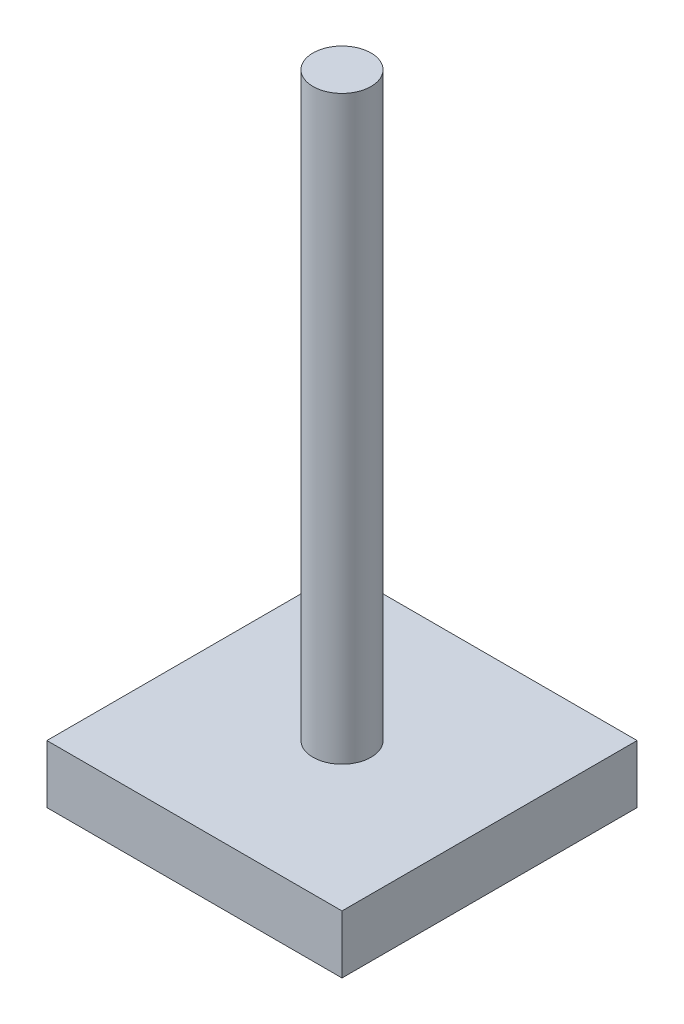
ISO-10303-21;
HEADER;
FILE_DESCRIPTION(('STEP AP214'),'2;1');
FILE_NAME('part.step','',(''),(''),'','','');
FILE_SCHEMA(('AUTOMOTIVE_DESIGN { 1 0 10303 214 1 1 1 1 }'));
ENDSEC;
DATA;
#1=APPLICATION_CONTEXT('core data for automotive mechanical design processes');
#2=APPLICATION_PROTOCOL_DEFINITION('international standard','automotive_design',2000,#1);
#3=PRODUCT_CONTEXT('',#1,'mechanical');
#4=PRODUCT('Part','Part','',(#3));
#5=PRODUCT_RELATED_PRODUCT_CATEGORY('part','',(#4));
#6=PRODUCT_DEFINITION_FORMATION('','',#4);
#7=PRODUCT_DEFINITION_CONTEXT('part definition',#1,'design');
#8=PRODUCT_DEFINITION('design','',#6,#7);
#9=PRODUCT_DEFINITION_SHAPE('','',#8);
#10=(LENGTH_UNIT() NAMED_UNIT(*) SI_UNIT(.MILLI.,.METRE.));
#11=(NAMED_UNIT(*) PLANE_ANGLE_UNIT() SI_UNIT($,.RADIAN.));
#12=(NAMED_UNIT(*) SI_UNIT($,.STERADIAN.) SOLID_ANGLE_UNIT());
#13=UNCERTAINTY_MEASURE_WITH_UNIT(LENGTH_MEASURE(1.E-05),#10,'distance_accuracy_value','');
#14=(GEOMETRIC_REPRESENTATION_CONTEXT(3) GLOBAL_UNCERTAINTY_ASSIGNED_CONTEXT((#13)) GLOBAL_UNIT_ASSIGNED_CONTEXT((#10,
#11,#12)) REPRESENTATION_CONTEXT('',''));
#15=CARTESIAN_POINT('',(0.,0.,0.));
#16=DIRECTION('',(0.,0.,1.));
#17=DIRECTION('',(1.,0.,0.));
#18=AXIS2_PLACEMENT_3D('',#15,#16,#17);
#19=CARTESIAN_POINT('',(-25.4,10.,25.4));
#20=DIRECTION('',(0.,0.,-1.));
#21=DIRECTION('',(-1.,0.,0.));
#22=AXIS2_PLACEMENT_3D('',#19,#20,#21);
#23=PLANE('',#22);
#24=DIRECTION('',(1.,0.,0.));
#25=VECTOR('',#24,1.);
#26=CARTESIAN_POINT('',(-25.4,0.,25.4));
#27=LINE('',#26,#25);
#28=CARTESIAN_POINT('',(-25.4,0.,25.4));
#29=VERTEX_POINT('',#28);
#30=CARTESIAN_POINT('',(25.4,0.,25.4));
#31=VERTEX_POINT('',#30);
#32=EDGE_CURVE('E107',#29,#31,#27,.T.);
#33=ORIENTED_EDGE('',*,*,#32,.T.);
#34=DIRECTION('',(0.,-1.,0.));
#35=VECTOR('',#34,1.);
#36=CARTESIAN_POINT('',(25.4,10.,25.4));
#37=LINE('',#36,#35);
#38=CARTESIAN_POINT('',(25.4,10.,25.4));
#39=VERTEX_POINT('',#38);
#40=EDGE_CURVE('E11',#39,#31,#37,.T.);
#41=ORIENTED_EDGE('',*,*,#40,.F.);
#42=DIRECTION('',(1.,0.,0.));
#43=VECTOR('',#42,1.);
#44=CARTESIAN_POINT('',(-25.4,10.,25.4));
#45=LINE('',#44,#43);
#46=CARTESIAN_POINT('',(-25.4,10.,25.4));
#47=VERTEX_POINT('',#46);
#48=EDGE_CURVE('E89',#47,#39,#45,.T.);
#49=ORIENTED_EDGE('',*,*,#48,.F.);
#50=DIRECTION('',(0.,-1.,0.));
#51=VECTOR('',#50,1.);
#52=CARTESIAN_POINT('',(-25.4,10.,25.4));
#53=LINE('',#52,#51);
#54=EDGE_CURVE('E56',#47,#29,#53,.T.);
#55=ORIENTED_EDGE('',*,*,#54,.T.);
#56=EDGE_LOOP('',(#33,#41,#49,#55));
#57=FACE_BOUND('',#56,.T.);
#58=ADVANCED_FACE('F39',(#57),#23,.F.);
#59=CARTESIAN_POINT('',(25.4,10.,25.4));
#60=DIRECTION('',(-1.,0.,0.));
#61=DIRECTION('',(0.,0.,1.));
#62=AXIS2_PLACEMENT_3D('',#59,#60,#61);
#63=PLANE('',#62);
#64=DIRECTION('',(0.,0.,-1.));
#65=VECTOR('',#64,1.);
#66=CARTESIAN_POINT('',(25.4,0.,25.4));
#67=LINE('',#66,#65);
#68=CARTESIAN_POINT('',(25.4,0.,-25.4));
#69=VERTEX_POINT('',#68);
#70=EDGE_CURVE('E95',#31,#69,#67,.T.);
#71=ORIENTED_EDGE('',*,*,#70,.T.);
#72=DIRECTION('',(0.,-1.,0.));
#73=VECTOR('',#72,1.);
#74=CARTESIAN_POINT('',(25.4,10.,-25.4));
#75=LINE('',#74,#73);
#76=CARTESIAN_POINT('',(25.4,10.,-25.4));
#77=VERTEX_POINT('',#76);
#78=EDGE_CURVE('E48',#77,#69,#75,.T.);
#79=ORIENTED_EDGE('',*,*,#78,.F.);
#80=DIRECTION('',(0.,0.,-1.));
#81=VECTOR('',#80,1.);
#82=CARTESIAN_POINT('',(25.4,10.,25.4));
#83=LINE('',#82,#81);
#84=EDGE_CURVE('E81',#39,#77,#83,.T.);
#85=ORIENTED_EDGE('',*,*,#84,.F.);
#86=ORIENTED_EDGE('',*,*,#40,.T.);
#87=EDGE_LOOP('',(#71,#79,#85,#86));
#88=FACE_BOUND('',#87,.T.);
#89=ADVANCED_FACE('F94',(#88),#63,.F.);
#90=CARTESIAN_POINT('',(-25.4,10.,-25.4));
#91=DIRECTION('',(0.,0.,-1.));
#92=DIRECTION('',(-1.,0.,0.));
#93=AXIS2_PLACEMENT_3D('',#90,#91,#92);
#94=PLANE('',#93);
#95=DIRECTION('',(1.,0.,0.));
#96=VECTOR('',#95,1.);
#97=CARTESIAN_POINT('',(-25.4,0.,-25.4));
#98=LINE('',#97,#96);
#99=CARTESIAN_POINT('',(-25.4,0.,-25.4));
#100=VERTEX_POINT('',#99);
#101=EDGE_CURVE('E113',#100,#69,#98,.T.);
#102=ORIENTED_EDGE('',*,*,#101,.F.);
#103=DIRECTION('',(0.,-1.,0.));
#104=VECTOR('',#103,1.);
#105=CARTESIAN_POINT('',(-25.4,10.,-25.4));
#106=LINE('',#105,#104);
#107=CARTESIAN_POINT('',(-25.4,10.,-25.4));
#108=VERTEX_POINT('',#107);
#109=EDGE_CURVE('E70',#108,#100,#106,.T.);
#110=ORIENTED_EDGE('',*,*,#109,.F.);
#111=DIRECTION('',(1.,0.,0.));
#112=VECTOR('',#111,1.);
#113=CARTESIAN_POINT('',(-25.4,10.,-25.4));
#114=LINE('',#113,#112);
#115=EDGE_CURVE('E88',#108,#77,#114,.T.);
#116=ORIENTED_EDGE('',*,*,#115,.T.);
#117=ORIENTED_EDGE('',*,*,#78,.T.);
#118=EDGE_LOOP('',(#102,#110,#116,#117));
#119=FACE_BOUND('',#118,.T.);
#120=ADVANCED_FACE('F99',(#119),#94,.T.);
#121=CARTESIAN_POINT('',(-25.4,10.,25.4));
#122=DIRECTION('',(-1.,0.,0.));
#123=DIRECTION('',(0.,0.,1.));
#124=AXIS2_PLACEMENT_3D('',#121,#122,#123);
#125=PLANE('',#124);
#126=DIRECTION('',(0.,0.,-1.));
#127=VECTOR('',#126,1.);
#128=CARTESIAN_POINT('',(-25.4,0.,25.4));
#129=LINE('',#128,#127);
#130=EDGE_CURVE('E116',#29,#100,#129,.T.);
#131=ORIENTED_EDGE('',*,*,#130,.F.);
#132=ORIENTED_EDGE('',*,*,#54,.F.);
#133=DIRECTION('',(0.,0.,-1.));
#134=VECTOR('',#133,1.);
#135=CARTESIAN_POINT('',(-25.4,10.,25.4));
#136=LINE('',#135,#134);
#137=EDGE_CURVE('E101',#47,#108,#136,.T.);
#138=ORIENTED_EDGE('',*,*,#137,.T.);
#139=ORIENTED_EDGE('',*,*,#109,.T.);
#140=EDGE_LOOP('',(#131,#132,#138,#139));
#141=FACE_BOUND('',#140,.T.);
#142=ADVANCED_FACE('F144',(#141),#125,.T.);
#143=CARTESIAN_POINT('',(0.,10.,0.));
#144=DIRECTION('',(0.,1.,0.));
#145=DIRECTION('',(0.,0.,1.));
#146=AXIS2_PLACEMENT_3D('',#143,#144,#145);
#147=PLANE('',#146);
#148=CARTESIAN_POINT('',(0.,10.,0.));
#149=DIRECTION('',(0.,1.,0.));
#150=DIRECTION('',(0.,0.,1.));
#151=AXIS2_PLACEMENT_3D('',#148,#149,#150);
#152=CIRCLE('',#151,5.);
#153=CARTESIAN_POINT('',(0.,10.,5.));
#154=VERTEX_POINT('',#153);
#155=EDGE_CURVE('E126',#154,#154,#152,.T.);
#156=ORIENTED_EDGE('',*,*,#155,.F.);
#157=EDGE_LOOP('',(#156));
#158=FACE_BOUND('',#157,.T.);
#159=ORIENTED_EDGE('',*,*,#48,.T.);
#160=ORIENTED_EDGE('',*,*,#84,.T.);
#161=ORIENTED_EDGE('',*,*,#115,.F.);
#162=ORIENTED_EDGE('',*,*,#137,.F.);
#163=EDGE_LOOP('',(#159,#160,#161,#162));
#164=FACE_BOUND('',#163,.T.);
#165=ADVANCED_FACE('F85',(#158,#164),#147,.T.);
#166=CARTESIAN_POINT('',(0.,0.,0.));
#167=DIRECTION('',(0.,1.,0.));
#168=DIRECTION('',(0.,0.,1.));
#169=AXIS2_PLACEMENT_3D('',#166,#167,#168);
#170=PLANE('',#169);
#171=ORIENTED_EDGE('',*,*,#32,.F.);
#172=ORIENTED_EDGE('',*,*,#130,.T.);
#173=ORIENTED_EDGE('',*,*,#101,.T.);
#174=ORIENTED_EDGE('',*,*,#70,.F.);
#175=EDGE_LOOP('',(#171,#172,#173,#174));
#176=FACE_BOUND('',#175,.T.);
#177=ADVANCED_FACE('F139',(#176),#170,.F.);
#178=CARTESIAN_POINT('',(0.,110.,0.));
#179=DIRECTION('',(0.,-1.,0.));
#180=DIRECTION('',(0.,0.,-1.));
#181=AXIS2_PLACEMENT_3D('',#178,#179,#180);
#182=CYLINDRICAL_SURFACE('',#181,5.);
#183=CARTESIAN_POINT('',(0.,110.,0.));
#184=DIRECTION('',(0.,1.,0.));
#185=DIRECTION('',(0.,0.,1.));
#186=AXIS2_PLACEMENT_3D('',#183,#184,#185);
#187=CIRCLE('',#186,5.);
#188=CARTESIAN_POINT('',(0.,110.,5.));
#189=VERTEX_POINT('',#188);
#190=EDGE_CURVE('E110',#189,#189,#187,.T.);
#191=ORIENTED_EDGE('',*,*,#190,.F.);
#192=EDGE_LOOP('',(#191));
#193=FACE_BOUND('',#192,.T.);
#194=ORIENTED_EDGE('',*,*,#155,.T.);
#195=EDGE_LOOP('',(#194));
#196=FACE_BOUND('',#195,.T.);
#197=ADVANCED_FACE('F136',(#193,#196),#182,.T.);
#198=CARTESIAN_POINT('',(0.,110.,0.));
#199=DIRECTION('',(0.,1.,0.));
#200=DIRECTION('',(0.,0.,1.));
#201=AXIS2_PLACEMENT_3D('',#198,#199,#200);
#202=PLANE('',#201);
#203=ORIENTED_EDGE('',*,*,#190,.T.);
#204=EDGE_LOOP('',(#203));
#205=FACE_BOUND('',#204,.T.);
#206=ADVANCED_FACE('F134',(#205),#202,.T.);
#207=CLOSED_SHELL('',(#58,#89,#120,#142,#165,#177,#197,#206));
#208=MANIFOLD_SOLID_BREP('B2',#207);
#209=ADVANCED_BREP_SHAPE_REPRESENTATION('',(#18,#208),#14);
#210=SHAPE_DEFINITION_REPRESENTATION(#9,#209);
ENDSEC;
END-ISO-10303-21;
